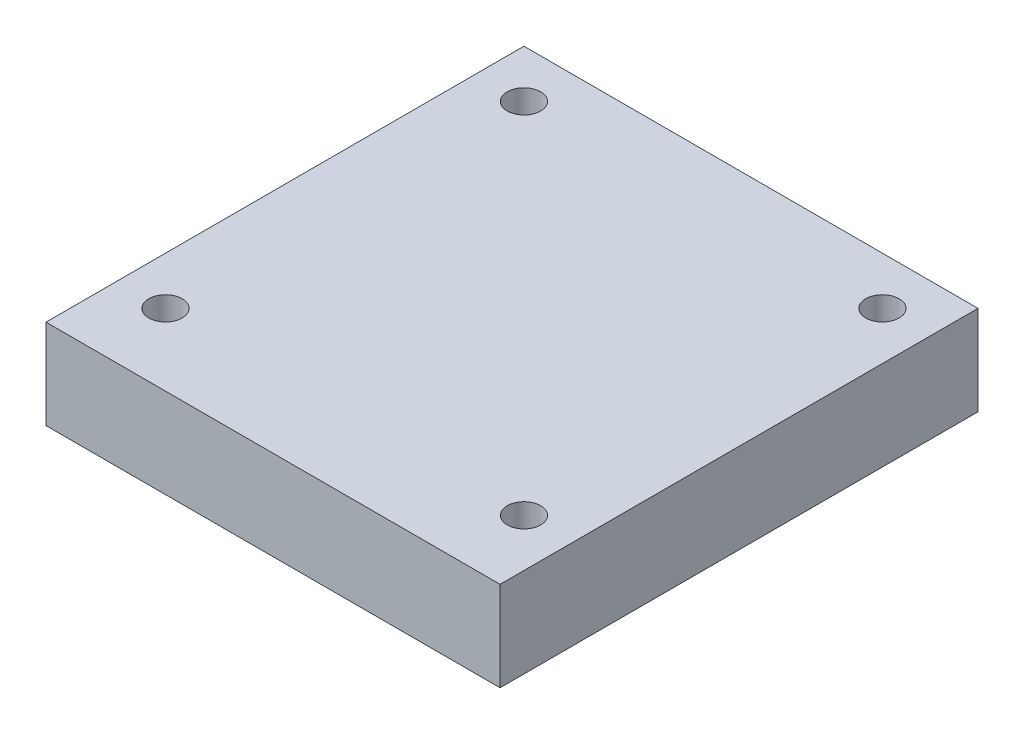
ISO-10303-21;
HEADER;
FILE_DESCRIPTION(('STEP AP214'),'2;1');
FILE_NAME('part.step','',(''),(''),'','','');
FILE_SCHEMA(('AUTOMOTIVE_DESIGN { 1 0 10303 214 1 1 1 1 }'));
ENDSEC;
DATA;
#1=APPLICATION_CONTEXT('core data for automotive mechanical design processes');
#2=APPLICATION_PROTOCOL_DEFINITION('international standard','automotive_design',2000,#1);
#3=PRODUCT_CONTEXT('',#1,'mechanical');
#4=PRODUCT('Part','Part','',(#3));
#5=PRODUCT_RELATED_PRODUCT_CATEGORY('part','',(#4));
#6=PRODUCT_DEFINITION_FORMATION('','',#4);
#7=PRODUCT_DEFINITION_CONTEXT('part definition',#1,'design');
#8=PRODUCT_DEFINITION('design','',#6,#7);
#9=PRODUCT_DEFINITION_SHAPE('','',#8);
#10=(LENGTH_UNIT() NAMED_UNIT(*) SI_UNIT(.MILLI.,.METRE.));
#11=(NAMED_UNIT(*) PLANE_ANGLE_UNIT() SI_UNIT($,.RADIAN.));
#12=(NAMED_UNIT(*) SI_UNIT($,.STERADIAN.) SOLID_ANGLE_UNIT());
#13=UNCERTAINTY_MEASURE_WITH_UNIT(LENGTH_MEASURE(1.E-05),#10,'distance_accuracy_value','');
#14=(GEOMETRIC_REPRESENTATION_CONTEXT(3) GLOBAL_UNCERTAINTY_ASSIGNED_CONTEXT((#13)) GLOBAL_UNIT_ASSIGNED_CONTEXT((#10,
#11,#12)) REPRESENTATION_CONTEXT('',''));
#15=CARTESIAN_POINT('',(0.,0.,0.));
#16=DIRECTION('',(0.,0.,1.));
#17=DIRECTION('',(1.,0.,0.));
#18=AXIS2_PLACEMENT_3D('',#15,#16,#17);
#19=CARTESIAN_POINT('',(0.,7.5,0.));
#20=DIRECTION('',(0.,-1.,0.));
#21=DIRECTION('',(0.,0.,-1.));
#22=AXIS2_PLACEMENT_3D('',#19,#20,#21);
#23=PLANE('',#22);
#24=DIRECTION('',(0.,0.,1.));
#25=VECTOR('',#24,1.);
#26=CARTESIAN_POINT('',(0.,7.5,0.));
#27=LINE('',#26,#25);
#28=CARTESIAN_POINT('',(0.,7.5,-40.));
#29=VERTEX_POINT('',#28);
#30=CARTESIAN_POINT('',(0.,7.5,0.));
#31=VERTEX_POINT('',#30);
#32=EDGE_CURVE('E87',#29,#31,#27,.T.);
#33=ORIENTED_EDGE('',*,*,#32,.T.);
#34=DIRECTION('',(1.,0.,0.));
#35=VECTOR('',#34,1.);
#36=CARTESIAN_POINT('',(0.,7.5,0.));
#37=LINE('',#36,#35);
#38=CARTESIAN_POINT('',(38.,7.5,0.));
#39=VERTEX_POINT('',#38);
#40=EDGE_CURVE('E82',#31,#39,#37,.T.);
#41=ORIENTED_EDGE('',*,*,#40,.T.);
#42=DIRECTION('',(0.,0.,-1.));
#43=VECTOR('',#42,1.);
#44=CARTESIAN_POINT('',(38.,7.5,0.));
#45=LINE('',#44,#43);
#46=CARTESIAN_POINT('',(38.,7.5,-40.));
#47=VERTEX_POINT('',#46);
#48=EDGE_CURVE('E85',#39,#47,#45,.T.);
#49=ORIENTED_EDGE('',*,*,#48,.T.);
#50=DIRECTION('',(-1.,0.,0.));
#51=VECTOR('',#50,1.);
#52=CARTESIAN_POINT('',(0.,7.5,-40.));
#53=LINE('',#52,#51);
#54=EDGE_CURVE('E52',#47,#29,#53,.T.);
#55=ORIENTED_EDGE('',*,*,#54,.T.);
#56=EDGE_LOOP('',(#33,#41,#49,#55));
#57=FACE_BOUND('',#56,.T.);
#58=CARTESIAN_POINT('',(4.,7.5,-36.));
#59=DIRECTION('',(0.,1.,0.));
#60=DIRECTION('',(0.,0.,1.));
#61=AXIS2_PLACEMENT_3D('',#58,#59,#60);
#62=CIRCLE('',#61,1.39791605430075);
#63=CARTESIAN_POINT('',(4.,7.5,-34.6020839456993));
#64=VERTEX_POINT('',#63);
#65=EDGE_CURVE('E102',#64,#64,#62,.T.);
#66=ORIENTED_EDGE('',*,*,#65,.F.);
#67=EDGE_LOOP('',(#66));
#68=FACE_BOUND('',#67,.T.);
#69=CARTESIAN_POINT('',(34.,7.5,-36.));
#70=DIRECTION('',(0.,1.,0.));
#71=DIRECTION('',(0.,0.,1.));
#72=AXIS2_PLACEMENT_3D('',#69,#70,#71);
#73=CIRCLE('',#72,1.39791605430075);
#74=CARTESIAN_POINT('',(34.,7.5,-34.6020839456993));
#75=VERTEX_POINT('',#74);
#76=EDGE_CURVE('E117',#75,#75,#73,.T.);
#77=ORIENTED_EDGE('',*,*,#76,.F.);
#78=EDGE_LOOP('',(#77));
#79=FACE_BOUND('',#78,.T.);
#80=CARTESIAN_POINT('',(4.,7.5,-6.00000000000001));
#81=DIRECTION('',(0.,1.,0.));
#82=DIRECTION('',(0.,0.,1.));
#83=AXIS2_PLACEMENT_3D('',#80,#81,#82);
#84=CIRCLE('',#83,1.39791605430074);
#85=CARTESIAN_POINT('',(4.,7.5,-4.60208394569926));
#86=VERTEX_POINT('',#85);
#87=EDGE_CURVE('E123',#86,#86,#84,.T.);
#88=ORIENTED_EDGE('',*,*,#87,.F.);
#89=EDGE_LOOP('',(#88));
#90=FACE_BOUND('',#89,.T.);
#91=CARTESIAN_POINT('',(34.,7.5,-6.00000000000001));
#92=DIRECTION('',(0.,1.,0.));
#93=DIRECTION('',(0.,0.,1.));
#94=AXIS2_PLACEMENT_3D('',#91,#92,#93);
#95=CIRCLE('',#94,1.39791605430075);
#96=CARTESIAN_POINT('',(34.,7.5,-4.60208394569926));
#97=VERTEX_POINT('',#96);
#98=EDGE_CURVE('E129',#97,#97,#95,.T.);
#99=ORIENTED_EDGE('',*,*,#98,.F.);
#100=EDGE_LOOP('',(#99));
#101=FACE_BOUND('',#100,.T.);
#102=ADVANCED_FACE('F35',(#57,#68,#79,#90,#101),#23,.F.);
#103=CARTESIAN_POINT('',(0.,0.,0.));
#104=DIRECTION('',(0.,-1.,0.));
#105=DIRECTION('',(0.,0.,-1.));
#106=AXIS2_PLACEMENT_3D('',#103,#104,#105);
#107=PLANE('',#106);
#108=CARTESIAN_POINT('',(4.,0.,-6.00000000000001));
#109=DIRECTION('',(0.,1.,0.));
#110=DIRECTION('',(0.,0.,1.));
#111=AXIS2_PLACEMENT_3D('',#108,#109,#110);
#112=CIRCLE('',#111,1.39791605430074);
#113=CARTESIAN_POINT('',(4.,0.,-4.60208394569926));
#114=VERTEX_POINT('',#113);
#115=EDGE_CURVE('E126',#114,#114,#112,.T.);
#116=ORIENTED_EDGE('',*,*,#115,.T.);
#117=EDGE_LOOP('',(#116));
#118=FACE_BOUND('',#117,.T.);
#119=CARTESIAN_POINT('',(4.,0.,-36.));
#120=DIRECTION('',(0.,1.,0.));
#121=DIRECTION('',(0.,0.,1.));
#122=AXIS2_PLACEMENT_3D('',#119,#120,#121);
#123=CIRCLE('',#122,1.39791605430075);
#124=CARTESIAN_POINT('',(4.,0.,-34.6020839456993));
#125=VERTEX_POINT('',#124);
#126=EDGE_CURVE('E114',#125,#125,#123,.T.);
#127=ORIENTED_EDGE('',*,*,#126,.T.);
#128=EDGE_LOOP('',(#127));
#129=FACE_BOUND('',#128,.T.);
#130=DIRECTION('',(0.,0.,1.));
#131=VECTOR('',#130,1.);
#132=CARTESIAN_POINT('',(0.,0.,0.));
#133=LINE('',#132,#131);
#134=CARTESIAN_POINT('',(0.,0.,-40.));
#135=VERTEX_POINT('',#134);
#136=CARTESIAN_POINT('',(0.,0.,0.));
#137=VERTEX_POINT('',#136);
#138=EDGE_CURVE('E99',#135,#137,#133,.T.);
#139=ORIENTED_EDGE('',*,*,#138,.F.);
#140=DIRECTION('',(-1.,0.,0.));
#141=VECTOR('',#140,1.);
#142=CARTESIAN_POINT('',(0.,0.,-40.));
#143=LINE('',#142,#141);
#144=CARTESIAN_POINT('',(38.,0.,-40.));
#145=VERTEX_POINT('',#144);
#146=EDGE_CURVE('E75',#145,#135,#143,.T.);
#147=ORIENTED_EDGE('',*,*,#146,.F.);
#148=DIRECTION('',(0.,0.,-1.));
#149=VECTOR('',#148,1.);
#150=CARTESIAN_POINT('',(38.,0.,0.));
#151=LINE('',#150,#149);
#152=CARTESIAN_POINT('',(38.,0.,0.));
#153=VERTEX_POINT('',#152);
#154=EDGE_CURVE('E69',#153,#145,#151,.T.);
#155=ORIENTED_EDGE('',*,*,#154,.F.);
#156=DIRECTION('',(1.,0.,0.));
#157=VECTOR('',#156,1.);
#158=CARTESIAN_POINT('',(0.,0.,0.));
#159=LINE('',#158,#157);
#160=EDGE_CURVE('E91',#137,#153,#159,.T.);
#161=ORIENTED_EDGE('',*,*,#160,.F.);
#162=EDGE_LOOP('',(#139,#147,#155,#161));
#163=FACE_BOUND('',#162,.T.);
#164=CARTESIAN_POINT('',(34.,0.,-36.));
#165=DIRECTION('',(0.,1.,0.));
#166=DIRECTION('',(0.,0.,1.));
#167=AXIS2_PLACEMENT_3D('',#164,#165,#166);
#168=CIRCLE('',#167,1.39791605430075);
#169=CARTESIAN_POINT('',(34.,0.,-34.6020839456993));
#170=VERTEX_POINT('',#169);
#171=EDGE_CURVE('E120',#170,#170,#168,.T.);
#172=ORIENTED_EDGE('',*,*,#171,.T.);
#173=EDGE_LOOP('',(#172));
#174=FACE_BOUND('',#173,.T.);
#175=CARTESIAN_POINT('',(34.,0.,-6.00000000000001));
#176=DIRECTION('',(0.,1.,0.));
#177=DIRECTION('',(0.,0.,1.));
#178=AXIS2_PLACEMENT_3D('',#175,#176,#177);
#179=CIRCLE('',#178,1.39791605430075);
#180=CARTESIAN_POINT('',(34.,0.,-4.60208394569926));
#181=VERTEX_POINT('',#180);
#182=EDGE_CURVE('E132',#181,#181,#179,.T.);
#183=ORIENTED_EDGE('',*,*,#182,.T.);
#184=EDGE_LOOP('',(#183));
#185=FACE_BOUND('',#184,.T.);
#186=ADVANCED_FACE('F110',(#118,#129,#163,#174,#185),#107,.T.);
#187=CARTESIAN_POINT('',(0.,7.5,0.));
#188=DIRECTION('',(1.,0.,0.));
#189=DIRECTION('',(0.,0.,-1.));
#190=AXIS2_PLACEMENT_3D('',#187,#188,#189);
#191=PLANE('',#190);
#192=ORIENTED_EDGE('',*,*,#138,.T.);
#193=DIRECTION('',(0.,-1.,0.));
#194=VECTOR('',#193,1.);
#195=CARTESIAN_POINT('',(0.,7.5,0.));
#196=LINE('',#195,#194);
#197=EDGE_CURVE('E11',#31,#137,#196,.T.);
#198=ORIENTED_EDGE('',*,*,#197,.F.);
#199=ORIENTED_EDGE('',*,*,#32,.F.);
#200=DIRECTION('',(0.,-1.,0.));
#201=VECTOR('',#200,1.);
#202=CARTESIAN_POINT('',(0.,7.5,-40.));
#203=LINE('',#202,#201);
#204=EDGE_CURVE('E95',#29,#135,#203,.T.);
#205=ORIENTED_EDGE('',*,*,#204,.T.);
#206=EDGE_LOOP('',(#192,#198,#199,#205));
#207=FACE_BOUND('',#206,.T.);
#208=ADVANCED_FACE('F37',(#207),#191,.F.);
#209=CARTESIAN_POINT('',(0.,7.5,0.));
#210=DIRECTION('',(0.,0.,-1.));
#211=DIRECTION('',(-1.,0.,0.));
#212=AXIS2_PLACEMENT_3D('',#209,#210,#211);
#213=PLANE('',#212);
#214=ORIENTED_EDGE('',*,*,#160,.T.);
#215=DIRECTION('',(0.,-1.,0.));
#216=VECTOR('',#215,1.);
#217=CARTESIAN_POINT('',(38.,7.5,0.));
#218=LINE('',#217,#216);
#219=EDGE_CURVE('E44',#39,#153,#218,.T.);
#220=ORIENTED_EDGE('',*,*,#219,.F.);
#221=ORIENTED_EDGE('',*,*,#40,.F.);
#222=ORIENTED_EDGE('',*,*,#197,.T.);
#223=EDGE_LOOP('',(#214,#220,#221,#222));
#224=FACE_BOUND('',#223,.T.);
#225=ADVANCED_FACE('F90',(#224),#213,.F.);
#226=CARTESIAN_POINT('',(38.,7.5,0.));
#227=DIRECTION('',(-1.,0.,0.));
#228=DIRECTION('',(0.,0.,1.));
#229=AXIS2_PLACEMENT_3D('',#226,#227,#228);
#230=PLANE('',#229);
#231=ORIENTED_EDGE('',*,*,#154,.T.);
#232=DIRECTION('',(0.,-1.,0.));
#233=VECTOR('',#232,1.);
#234=CARTESIAN_POINT('',(38.,7.5,-40.));
#235=LINE('',#234,#233);
#236=EDGE_CURVE('E92',#47,#145,#235,.T.);
#237=ORIENTED_EDGE('',*,*,#236,.F.);
#238=ORIENTED_EDGE('',*,*,#48,.F.);
#239=ORIENTED_EDGE('',*,*,#219,.T.);
#240=EDGE_LOOP('',(#231,#237,#238,#239));
#241=FACE_BOUND('',#240,.T.);
#242=ADVANCED_FACE('F93',(#241),#230,.F.);
#243=CARTESIAN_POINT('',(0.,7.5,-40.));
#244=DIRECTION('',(0.,0.,1.));
#245=DIRECTION('',(1.,0.,0.));
#246=AXIS2_PLACEMENT_3D('',#243,#244,#245);
#247=PLANE('',#246);
#248=ORIENTED_EDGE('',*,*,#146,.T.);
#249=ORIENTED_EDGE('',*,*,#204,.F.);
#250=ORIENTED_EDGE('',*,*,#54,.F.);
#251=ORIENTED_EDGE('',*,*,#236,.T.);
#252=EDGE_LOOP('',(#248,#249,#250,#251));
#253=FACE_BOUND('',#252,.T.);
#254=ADVANCED_FACE('F107',(#253),#247,.F.);
#255=CARTESIAN_POINT('',(4.,7.5,-36.));
#256=DIRECTION('',(0.,-1.,0.));
#257=DIRECTION('',(0.,0.,-1.));
#258=AXIS2_PLACEMENT_3D('',#255,#256,#257);
#259=CYLINDRICAL_SURFACE('',#258,1.39791605430075);
#260=ORIENTED_EDGE('',*,*,#65,.T.);
#261=EDGE_LOOP('',(#260));
#262=FACE_BOUND('',#261,.T.);
#263=ORIENTED_EDGE('',*,*,#126,.F.);
#264=EDGE_LOOP('',(#263));
#265=FACE_BOUND('',#264,.T.);
#266=ADVANCED_FACE('F149',(#262,#265),#259,.F.);
#267=CARTESIAN_POINT('',(34.,7.5,-36.));
#268=DIRECTION('',(0.,-1.,0.));
#269=DIRECTION('',(0.,0.,-1.));
#270=AXIS2_PLACEMENT_3D('',#267,#268,#269);
#271=CYLINDRICAL_SURFACE('',#270,1.39791605430075);
#272=ORIENTED_EDGE('',*,*,#76,.T.);
#273=EDGE_LOOP('',(#272));
#274=FACE_BOUND('',#273,.T.);
#275=ORIENTED_EDGE('',*,*,#171,.F.);
#276=EDGE_LOOP('',(#275));
#277=FACE_BOUND('',#276,.T.);
#278=ADVANCED_FACE('F195',(#274,#277),#271,.F.);
#279=CARTESIAN_POINT('',(4.,7.5,-6.00000000000001));
#280=DIRECTION('',(0.,-1.,0.));
#281=DIRECTION('',(0.,0.,-1.));
#282=AXIS2_PLACEMENT_3D('',#279,#280,#281);
#283=CYLINDRICAL_SURFACE('',#282,1.39791605430074);
#284=ORIENTED_EDGE('',*,*,#87,.T.);
#285=EDGE_LOOP('',(#284));
#286=FACE_BOUND('',#285,.T.);
#287=ORIENTED_EDGE('',*,*,#115,.F.);
#288=EDGE_LOOP('',(#287));
#289=FACE_BOUND('',#288,.T.);
#290=ADVANCED_FACE('F203',(#286,#289),#283,.F.);
#291=CARTESIAN_POINT('',(34.,7.5,-6.00000000000001));
#292=DIRECTION('',(0.,-1.,0.));
#293=DIRECTION('',(0.,0.,-1.));
#294=AXIS2_PLACEMENT_3D('',#291,#292,#293);
#295=CYLINDRICAL_SURFACE('',#294,1.39791605430075);
#296=ORIENTED_EDGE('',*,*,#98,.T.);
#297=EDGE_LOOP('',(#296));
#298=FACE_BOUND('',#297,.T.);
#299=ORIENTED_EDGE('',*,*,#182,.F.);
#300=EDGE_LOOP('',(#299));
#301=FACE_BOUND('',#300,.T.);
#302=ADVANCED_FACE('F138',(#298,#301),#295,.F.);
#303=CLOSED_SHELL('',(#102,#186,#208,#225,#242,#254,#266,#278,#290,#302));
#304=MANIFOLD_SOLID_BREP('B2',#303);
#305=ADVANCED_BREP_SHAPE_REPRESENTATION('',(#18,#304),#14);
#306=SHAPE_DEFINITION_REPRESENTATION(#9,#305);
ENDSEC;
END-ISO-10303-21;
